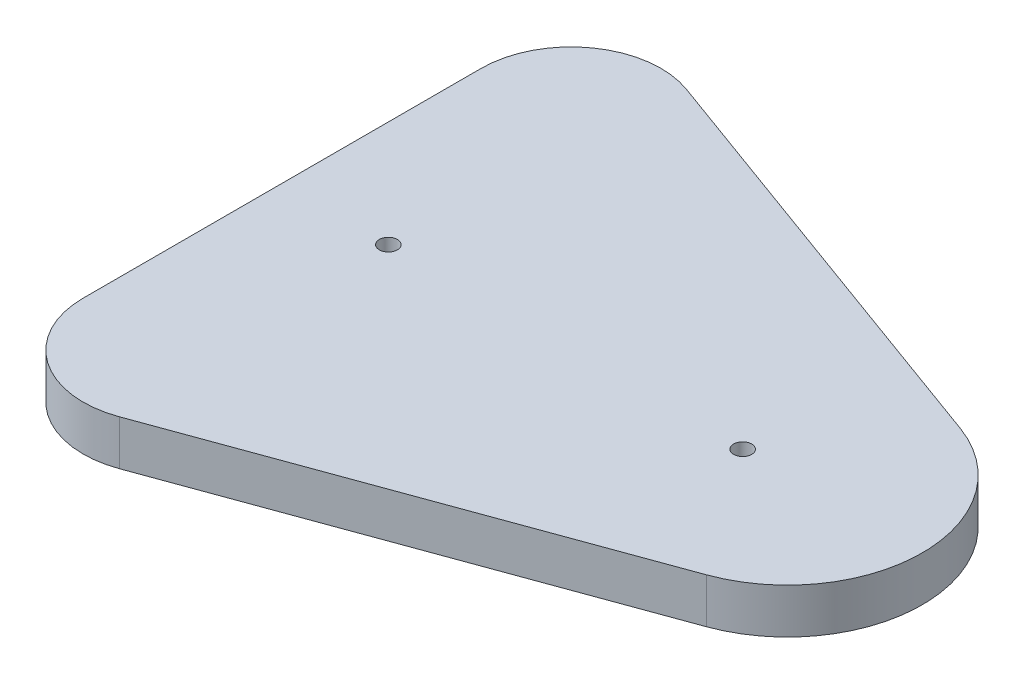
ISO-10303-21;
HEADER;
FILE_DESCRIPTION(('STEP AP214'),'2;1');
FILE_NAME('part.step','',(''),(''),'','','');
FILE_SCHEMA(('AUTOMOTIVE_DESIGN { 1 0 10303 214 1 1 1 1 }'));
ENDSEC;
DATA;
#1=APPLICATION_CONTEXT('core data for automotive mechanical design processes');
#2=APPLICATION_PROTOCOL_DEFINITION('international standard','automotive_design',2000,#1);
#3=PRODUCT_CONTEXT('',#1,'mechanical');
#4=PRODUCT('Part','Part','',(#3));
#5=PRODUCT_RELATED_PRODUCT_CATEGORY('part','',(#4));
#6=PRODUCT_DEFINITION_FORMATION('','',#4);
#7=PRODUCT_DEFINITION_CONTEXT('part definition',#1,'design');
#8=PRODUCT_DEFINITION('design','',#6,#7);
#9=PRODUCT_DEFINITION_SHAPE('','',#8);
#10=(LENGTH_UNIT() NAMED_UNIT(*) SI_UNIT(.MILLI.,.METRE.));
#11=(NAMED_UNIT(*) PLANE_ANGLE_UNIT() SI_UNIT($,.RADIAN.));
#12=(NAMED_UNIT(*) SI_UNIT($,.STERADIAN.) SOLID_ANGLE_UNIT());
#13=UNCERTAINTY_MEASURE_WITH_UNIT(LENGTH_MEASURE(1.E-05),#10,'distance_accuracy_value','');
#14=(GEOMETRIC_REPRESENTATION_CONTEXT(3) GLOBAL_UNCERTAINTY_ASSIGNED_CONTEXT((#13)) GLOBAL_UNIT_ASSIGNED_CONTEXT((#10,
#11,#12)) REPRESENTATION_CONTEXT('',''));
#15=CARTESIAN_POINT('',(0.,0.,0.));
#16=DIRECTION('',(0.,0.,1.));
#17=DIRECTION('',(1.,0.,0.));
#18=AXIS2_PLACEMENT_3D('',#15,#16,#17);
#19=CARTESIAN_POINT('',(0.,12.7,0.));
#20=DIRECTION('',(0.,-1.,0.));
#21=DIRECTION('',(0.,0.,-1.));
#22=AXIS2_PLACEMENT_3D('',#19,#20,#21);
#23=CYLINDRICAL_SURFACE('',#22,25.4);
#24=CARTESIAN_POINT('',(0.,0.,0.));
#25=DIRECTION('',(0.,1.,0.));
#26=DIRECTION('',(0.,0.,1.));
#27=AXIS2_PLACEMENT_3D('',#24,#25,#26);
#28=CIRCLE('',#27,25.4);
#29=CARTESIAN_POINT('',(-25.4,0.,0.));
#30=VERTEX_POINT('',#29);
#31=CARTESIAN_POINT('',(8.68757119984804,0.,23.8680980944769));
#32=VERTEX_POINT('',#31);
#33=EDGE_CURVE('E119',#30,#32,#28,.T.);
#34=ORIENTED_EDGE('',*,*,#33,.T.);
#35=DIRECTION('',(0.,-1.,0.));
#36=VECTOR('',#35,1.);
#37=CARTESIAN_POINT('',(8.68757119984804,12.7,23.8680980944769));
#38=LINE('',#37,#36);
#39=CARTESIAN_POINT('',(8.68757119984804,12.7,23.8680980944769));
#40=VERTEX_POINT('',#39);
#41=EDGE_CURVE('E11',#40,#32,#38,.T.);
#42=ORIENTED_EDGE('',*,*,#41,.F.);
#43=CARTESIAN_POINT('',(0.,12.7,0.));
#44=DIRECTION('',(0.,1.,0.));
#45=DIRECTION('',(0.,0.,1.));
#46=AXIS2_PLACEMENT_3D('',#43,#44,#45);
#47=CIRCLE('',#46,25.4);
#48=CARTESIAN_POINT('',(-25.4,12.7,0.));
#49=VERTEX_POINT('',#48);
#50=EDGE_CURVE('E130',#49,#40,#47,.T.);
#51=ORIENTED_EDGE('',*,*,#50,.F.);
#52=DIRECTION('',(0.,-1.,0.));
#53=VECTOR('',#52,1.);
#54=CARTESIAN_POINT('',(-25.4,12.7,0.));
#55=LINE('',#54,#53);
#56=EDGE_CURVE('E115',#49,#30,#55,.T.);
#57=ORIENTED_EDGE('',*,*,#56,.T.);
#58=EDGE_LOOP('',(#34,#42,#51,#57));
#59=FACE_BOUND('',#58,.T.);
#60=ADVANCED_FACE('F35',(#59),#23,.T.);
#61=CARTESIAN_POINT('',(8.68757119984804,12.7,23.8680980944769));
#62=DIRECTION('',(-0.342030362198742,0.,-0.939688901357357));
#63=DIRECTION('',(-0.939688901357357,0.,0.342030362198742));
#64=AXIS2_PLACEMENT_3D('',#61,#62,#63);
#65=PLANE('',#64);
#66=DIRECTION('',(0.939688901357357,0.,-0.342030362198742));
#67=VECTOR('',#66,1.);
#68=CARTESIAN_POINT('',(8.68757119984804,0.,23.8680980944769));
#69=LINE('',#68,#67);
#70=CARTESIAN_POINT('',(130.234472266043,0.,-20.3728528582847));
#71=VERTEX_POINT('',#70);
#72=EDGE_CURVE('E122',#32,#71,#69,.T.);
#73=ORIENTED_EDGE('',*,*,#72,.T.);
#74=DIRECTION('',(0.,-1.,0.));
#75=VECTOR('',#74,1.);
#76=CARTESIAN_POINT('',(130.234472266043,12.7,-20.3728528582847));
#77=LINE('',#76,#75);
#78=CARTESIAN_POINT('',(130.234472266043,12.7,-20.3728528582847));
#79=VERTEX_POINT('',#78);
#80=EDGE_CURVE('E43',#79,#71,#77,.T.);
#81=ORIENTED_EDGE('',*,*,#80,.F.);
#82=DIRECTION('',(0.939688901357357,0.,-0.342030362198742));
#83=VECTOR('',#82,1.);
#84=CARTESIAN_POINT('',(8.68757119984804,12.7,23.8680980944769));
#85=LINE('',#84,#83);
#86=EDGE_CURVE('E88',#40,#79,#85,.T.);
#87=ORIENTED_EDGE('',*,*,#86,.F.);
#88=ORIENTED_EDGE('',*,*,#41,.T.);
#89=EDGE_LOOP('',(#73,#81,#87,#88));
#90=FACE_BOUND('',#89,.T.);
#91=ADVANCED_FACE('F156',(#90),#65,.F.);
#92=CARTESIAN_POINT('',(117.203115466271,12.7,-56.175));
#93=DIRECTION('',(0.,-1.,0.));
#94=DIRECTION('',(0.,0.,-1.));
#95=AXIS2_PLACEMENT_3D('',#92,#93,#94);
#96=CYLINDRICAL_SURFACE('',#95,38.1);
#97=CARTESIAN_POINT('',(117.203115466271,0.,-56.175));
#98=DIRECTION('',(0.,1.,0.));
#99=DIRECTION('',(0.,0.,1.));
#100=AXIS2_PLACEMENT_3D('',#97,#98,#99);
#101=CIRCLE('',#100,38.1);
#102=CARTESIAN_POINT('',(130.234472266043,0.,-91.9771471417153));
#103=VERTEX_POINT('',#102);
#104=EDGE_CURVE('E125',#71,#103,#101,.T.);
#105=ORIENTED_EDGE('',*,*,#104,.T.);
#106=DIRECTION('',(0.,-1.,0.));
#107=VECTOR('',#106,1.);
#108=CARTESIAN_POINT('',(130.234472266043,12.7,-91.9771471417153));
#109=LINE('',#108,#107);
#110=CARTESIAN_POINT('',(130.234472266043,12.7,-91.9771471417153));
#111=VERTEX_POINT('',#110);
#112=EDGE_CURVE('E110',#111,#103,#109,.T.);
#113=ORIENTED_EDGE('',*,*,#112,.F.);
#114=CARTESIAN_POINT('',(117.203115466271,12.7,-56.175));
#115=DIRECTION('',(0.,1.,0.));
#116=DIRECTION('',(0.,0.,1.));
#117=AXIS2_PLACEMENT_3D('',#114,#115,#116);
#118=CIRCLE('',#117,38.1);
#119=EDGE_CURVE('E101',#79,#111,#118,.T.);
#120=ORIENTED_EDGE('',*,*,#119,.F.);
#121=ORIENTED_EDGE('',*,*,#80,.T.);
#122=EDGE_LOOP('',(#105,#113,#120,#121));
#123=FACE_BOUND('',#122,.T.);
#124=ADVANCED_FACE('F136',(#123),#96,.T.);
#125=CARTESIAN_POINT('',(130.234472266043,12.7,-91.9771471417153));
#126=DIRECTION('',(-0.342030362198742,0.,0.939688901357357));
#127=DIRECTION('',(0.939688901357357,0.,0.342030362198742));
#128=AXIS2_PLACEMENT_3D('',#125,#126,#127);
#129=PLANE('',#128);
#130=DIRECTION('',(-0.939688901357357,0.,-0.342030362198742));
#131=VECTOR('',#130,1.);
#132=CARTESIAN_POINT('',(130.234472266043,0.,-91.9771471417153));
#133=LINE('',#132,#131);
#134=CARTESIAN_POINT('',(8.68757119984804,0.,-136.218098094477));
#135=VERTEX_POINT('',#134);
#136=EDGE_CURVE('E109',#103,#135,#133,.T.);
#137=ORIENTED_EDGE('',*,*,#136,.T.);
#138=DIRECTION('',(0.,-1.,0.));
#139=VECTOR('',#138,1.);
#140=CARTESIAN_POINT('',(8.68757119984804,12.7,-136.218098094477));
#141=LINE('',#140,#139);
#142=CARTESIAN_POINT('',(8.68757119984804,12.7,-136.218098094477));
#143=VERTEX_POINT('',#142);
#144=EDGE_CURVE('E106',#143,#135,#141,.T.);
#145=ORIENTED_EDGE('',*,*,#144,.F.);
#146=DIRECTION('',(-0.939688901357357,0.,-0.342030362198742));
#147=VECTOR('',#146,1.);
#148=CARTESIAN_POINT('',(130.234472266043,12.7,-91.9771471417153));
#149=LINE('',#148,#147);
#150=EDGE_CURVE('E95',#111,#143,#149,.T.);
#151=ORIENTED_EDGE('',*,*,#150,.F.);
#152=ORIENTED_EDGE('',*,*,#112,.T.);
#153=EDGE_LOOP('',(#137,#145,#151,#152));
#154=FACE_BOUND('',#153,.T.);
#155=ADVANCED_FACE('F107',(#154),#129,.F.);
#156=CARTESIAN_POINT('',(0.,12.7,-112.35));
#157=DIRECTION('',(0.,-1.,0.));
#158=DIRECTION('',(0.,0.,-1.));
#159=AXIS2_PLACEMENT_3D('',#156,#157,#158);
#160=CYLINDRICAL_SURFACE('',#159,25.4);
#161=CARTESIAN_POINT('',(0.,0.,-112.35));
#162=DIRECTION('',(0.,1.,0.));
#163=DIRECTION('',(0.,0.,1.));
#164=AXIS2_PLACEMENT_3D('',#161,#162,#163);
#165=CIRCLE('',#164,25.4);
#166=CARTESIAN_POINT('',(-25.4,0.,-112.35));
#167=VERTEX_POINT('',#166);
#168=EDGE_CURVE('E74',#135,#167,#165,.T.);
#169=ORIENTED_EDGE('',*,*,#168,.T.);
#170=DIRECTION('',(0.,-1.,0.));
#171=VECTOR('',#170,1.);
#172=CARTESIAN_POINT('',(-25.4,12.7,-112.35));
#173=LINE('',#172,#171);
#174=CARTESIAN_POINT('',(-25.4,12.7,-112.35));
#175=VERTEX_POINT('',#174);
#176=EDGE_CURVE('E111',#175,#167,#173,.T.);
#177=ORIENTED_EDGE('',*,*,#176,.F.);
#178=CARTESIAN_POINT('',(0.,12.7,-112.35));
#179=DIRECTION('',(0.,1.,0.));
#180=DIRECTION('',(0.,0.,1.));
#181=AXIS2_PLACEMENT_3D('',#178,#179,#180);
#182=CIRCLE('',#181,25.4);
#183=EDGE_CURVE('E99',#143,#175,#182,.T.);
#184=ORIENTED_EDGE('',*,*,#183,.F.);
#185=ORIENTED_EDGE('',*,*,#144,.T.);
#186=EDGE_LOOP('',(#169,#177,#184,#185));
#187=FACE_BOUND('',#186,.T.);
#188=ADVANCED_FACE('F113',(#187),#160,.T.);
#189=CARTESIAN_POINT('',(-25.4,12.7,-112.35));
#190=DIRECTION('',(1.,0.,0.));
#191=DIRECTION('',(0.,0.,-1.));
#192=AXIS2_PLACEMENT_3D('',#189,#190,#191);
#193=PLANE('',#192);
#194=DIRECTION('',(0.,0.,1.));
#195=VECTOR('',#194,1.);
#196=CARTESIAN_POINT('',(-25.4,0.,-112.35));
#197=LINE('',#196,#195);
#198=EDGE_CURVE('E80',#167,#30,#197,.T.);
#199=ORIENTED_EDGE('',*,*,#198,.T.);
#200=ORIENTED_EDGE('',*,*,#56,.F.);
#201=DIRECTION('',(0.,0.,1.));
#202=VECTOR('',#201,1.);
#203=CARTESIAN_POINT('',(-25.4,12.7,-112.35));
#204=LINE('',#203,#202);
#205=EDGE_CURVE('E51',#175,#49,#204,.T.);
#206=ORIENTED_EDGE('',*,*,#205,.F.);
#207=ORIENTED_EDGE('',*,*,#176,.T.);
#208=EDGE_LOOP('',(#199,#200,#206,#207));
#209=FACE_BOUND('',#208,.T.);
#210=ADVANCED_FACE('F143',(#209),#193,.F.);
#211=CARTESIAN_POINT('',(0.,12.7,0.));
#212=DIRECTION('',(0.,1.,0.));
#213=DIRECTION('',(0.,0.,1.));
#214=AXIS2_PLACEMENT_3D('',#211,#212,#213);
#215=PLANE('',#214);
#216=CARTESIAN_POINT('',(4.6,12.7,-56.175));
#217=DIRECTION('',(0.,1.,0.));
#218=DIRECTION('',(0.,0.,1.));
#219=AXIS2_PLACEMENT_3D('',#216,#217,#218);
#220=CIRCLE('',#219,2.55269999999999);
#221=CARTESIAN_POINT('',(4.6,12.7,-53.6223));
#222=VERTEX_POINT('',#221);
#223=EDGE_CURVE('E218',#222,#222,#220,.T.);
#224=ORIENTED_EDGE('',*,*,#223,.F.);
#225=EDGE_LOOP('',(#224));
#226=FACE_BOUND('',#225,.T.);
#227=CARTESIAN_POINT('',(104.6,12.7,-56.175));
#228=DIRECTION('',(0.,1.,0.));
#229=DIRECTION('',(0.,0.,1.));
#230=AXIS2_PLACEMENT_3D('',#227,#228,#229);
#231=CIRCLE('',#230,2.55269999999999);
#232=CARTESIAN_POINT('',(104.6,12.7,-53.6223));
#233=VERTEX_POINT('',#232);
#234=EDGE_CURVE('E222',#233,#233,#231,.T.);
#235=ORIENTED_EDGE('',*,*,#234,.F.);
#236=EDGE_LOOP('',(#235));
#237=FACE_BOUND('',#236,.T.);
#238=ORIENTED_EDGE('',*,*,#50,.T.);
#239=ORIENTED_EDGE('',*,*,#86,.T.);
#240=ORIENTED_EDGE('',*,*,#119,.T.);
#241=ORIENTED_EDGE('',*,*,#150,.T.);
#242=ORIENTED_EDGE('',*,*,#183,.T.);
#243=ORIENTED_EDGE('',*,*,#205,.T.);
#244=EDGE_LOOP('',(#238,#239,#240,#241,#242,#243));
#245=FACE_BOUND('',#244,.T.);
#246=ADVANCED_FACE('F97',(#226,#237,#245),#215,.T.);
#247=CARTESIAN_POINT('',(0.,0.,0.));
#248=DIRECTION('',(0.,1.,0.));
#249=DIRECTION('',(0.,0.,1.));
#250=AXIS2_PLACEMENT_3D('',#247,#248,#249);
#251=PLANE('',#250);
#252=CARTESIAN_POINT('',(4.6,0.,-56.175));
#253=DIRECTION('',(0.,1.,0.));
#254=DIRECTION('',(0.,0.,1.));
#255=AXIS2_PLACEMENT_3D('',#252,#253,#254);
#256=CIRCLE('',#255,2.55269999999999);
#257=CARTESIAN_POINT('',(4.6,0.,-53.6223));
#258=VERTEX_POINT('',#257);
#259=EDGE_CURVE('E221',#258,#258,#256,.T.);
#260=ORIENTED_EDGE('',*,*,#259,.T.);
#261=EDGE_LOOP('',(#260));
#262=FACE_BOUND('',#261,.T.);
#263=CARTESIAN_POINT('',(104.6,0.,-56.175));
#264=DIRECTION('',(0.,1.,0.));
#265=DIRECTION('',(0.,0.,1.));
#266=AXIS2_PLACEMENT_3D('',#263,#264,#265);
#267=CIRCLE('',#266,2.55269999999999);
#268=CARTESIAN_POINT('',(104.6,0.,-53.6223));
#269=VERTEX_POINT('',#268);
#270=EDGE_CURVE('E123',#269,#269,#267,.T.);
#271=ORIENTED_EDGE('',*,*,#270,.T.);
#272=EDGE_LOOP('',(#271));
#273=FACE_BOUND('',#272,.T.);
#274=ORIENTED_EDGE('',*,*,#33,.F.);
#275=ORIENTED_EDGE('',*,*,#198,.F.);
#276=ORIENTED_EDGE('',*,*,#168,.F.);
#277=ORIENTED_EDGE('',*,*,#136,.F.);
#278=ORIENTED_EDGE('',*,*,#104,.F.);
#279=ORIENTED_EDGE('',*,*,#72,.F.);
#280=EDGE_LOOP('',(#274,#275,#276,#277,#278,#279));
#281=FACE_BOUND('',#280,.T.);
#282=ADVANCED_FACE('F139',(#262,#273,#281),#251,.F.);
#283=CARTESIAN_POINT('',(104.6,12.7,-56.175));
#284=DIRECTION('',(0.,1.,0.));
#285=DIRECTION('',(0.,0.,1.));
#286=AXIS2_PLACEMENT_3D('',#283,#284,#285);
#287=CYLINDRICAL_SURFACE('',#286,2.55269999999999);
#288=ORIENTED_EDGE('',*,*,#234,.T.);
#289=EDGE_LOOP('',(#288));
#290=FACE_BOUND('',#289,.T.);
#291=ORIENTED_EDGE('',*,*,#270,.F.);
#292=EDGE_LOOP('',(#291));
#293=FACE_BOUND('',#292,.T.);
#294=ADVANCED_FACE('F189',(#290,#293),#287,.F.);
#295=CARTESIAN_POINT('',(4.6,12.7,-56.175));
#296=DIRECTION('',(0.,1.,0.));
#297=DIRECTION('',(0.,0.,1.));
#298=AXIS2_PLACEMENT_3D('',#295,#296,#297);
#299=CYLINDRICAL_SURFACE('',#298,2.55269999999999);
#300=ORIENTED_EDGE('',*,*,#223,.T.);
#301=EDGE_LOOP('',(#300));
#302=FACE_BOUND('',#301,.T.);
#303=ORIENTED_EDGE('',*,*,#259,.F.);
#304=EDGE_LOOP('',(#303));
#305=FACE_BOUND('',#304,.T.);
#306=ADVANCED_FACE('F198',(#302,#305),#299,.F.);
#307=CLOSED_SHELL('',(#60,#91,#124,#155,#188,#210,#246,#282,#294,#306));
#308=MANIFOLD_SOLID_BREP('B2',#307);
#309=ADVANCED_BREP_SHAPE_REPRESENTATION('',(#18,#308),#14);
#310=SHAPE_DEFINITION_REPRESENTATION(#9,#309);
ENDSEC;
END-ISO-10303-21;
